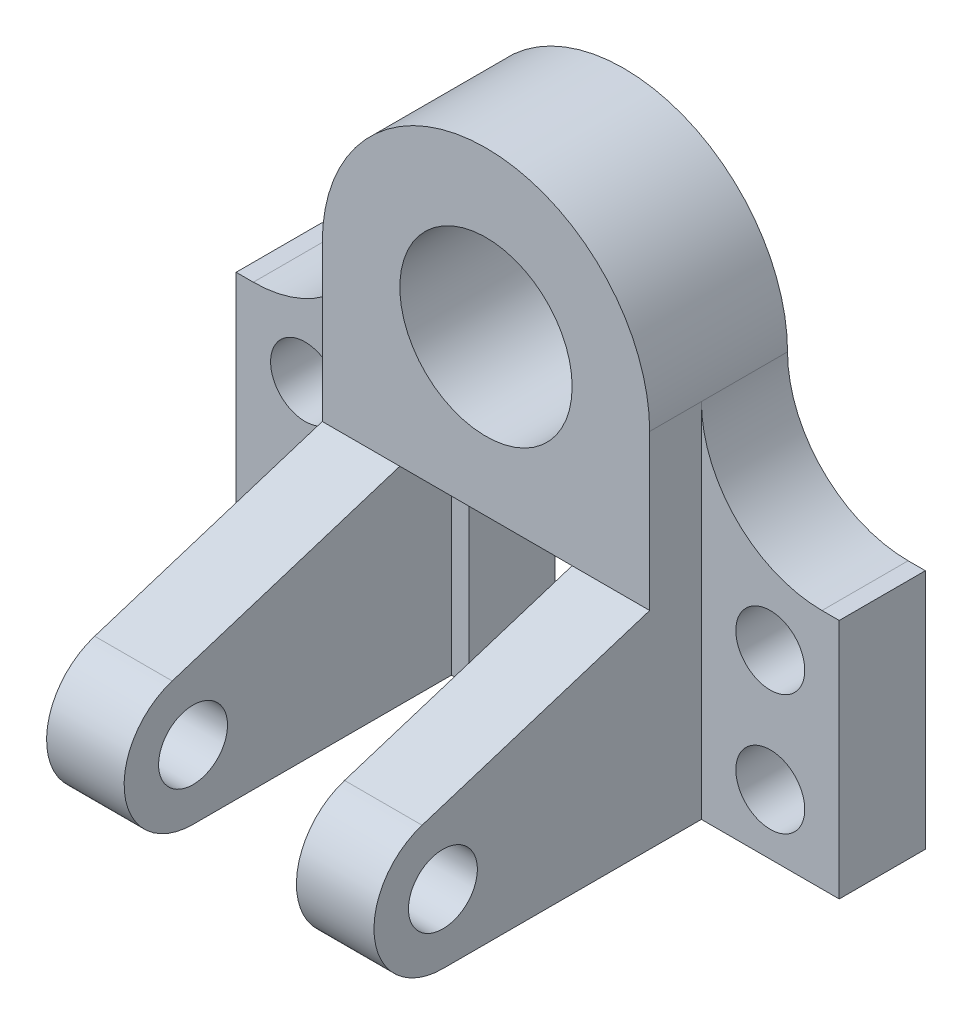
ISO-10303-21;
HEADER;
FILE_DESCRIPTION(('STEP AP214'),'2;1');
FILE_NAME('part.step','',(''),(''),'','','');
FILE_SCHEMA(('AUTOMOTIVE_DESIGN { 1 0 10303 214 1 1 1 1 }'));
ENDSEC;
DATA;
#1=APPLICATION_CONTEXT('core data for automotive mechanical design processes');
#2=APPLICATION_PROTOCOL_DEFINITION('international standard','automotive_design',2000,#1);
#3=PRODUCT_CONTEXT('',#1,'mechanical');
#4=PRODUCT('Part','Part','',(#3));
#5=PRODUCT_RELATED_PRODUCT_CATEGORY('part','',(#4));
#6=PRODUCT_DEFINITION_FORMATION('','',#4);
#7=PRODUCT_DEFINITION_CONTEXT('part definition',#1,'design');
#8=PRODUCT_DEFINITION('design','',#6,#7);
#9=PRODUCT_DEFINITION_SHAPE('','',#8);
#10=(LENGTH_UNIT() NAMED_UNIT(*) SI_UNIT(.MILLI.,.METRE.));
#11=(NAMED_UNIT(*) PLANE_ANGLE_UNIT() SI_UNIT($,.RADIAN.));
#12=(NAMED_UNIT(*) SI_UNIT($,.STERADIAN.) SOLID_ANGLE_UNIT());
#13=UNCERTAINTY_MEASURE_WITH_UNIT(LENGTH_MEASURE(1.E-05),#10,'distance_accuracy_value','');
#14=(GEOMETRIC_REPRESENTATION_CONTEXT(3) GLOBAL_UNCERTAINTY_ASSIGNED_CONTEXT((#13)) GLOBAL_UNIT_ASSIGNED_CONTEXT((#10,
#11,#12)) REPRESENTATION_CONTEXT('',''));
#15=CARTESIAN_POINT('',(0.,0.,0.));
#16=DIRECTION('',(0.,0.,1.));
#17=DIRECTION('',(1.,0.,0.));
#18=AXIS2_PLACEMENT_3D('',#15,#16,#17);
#19=CARTESIAN_POINT('',(-38.,-36.,32.));
#20=DIRECTION('',(0.,1.,0.));
#21=DIRECTION('',(0.,0.,1.));
#22=AXIS2_PLACEMENT_3D('',#19,#20,#21);
#23=PLANE('',#22);
#24=DIRECTION('',(0.,0.,-1.));
#25=VECTOR('',#24,1.);
#26=CARTESIAN_POINT('',(20.,-36.,32.));
#27=LINE('',#26,#25);
#28=CARTESIAN_POINT('',(20.,-36.,32.));
#29=VERTEX_POINT('',#28);
#30=CARTESIAN_POINT('',(20.,-36.,20.));
#31=VERTEX_POINT('',#30);
#32=EDGE_CURVE('E48',#29,#31,#27,.T.);
#33=ORIENTED_EDGE('',*,*,#32,.F.);
#34=DIRECTION('',(1.,0.,0.));
#35=VECTOR('',#34,1.);
#36=CARTESIAN_POINT('',(-38.,-36.,32.));
#37=LINE('',#36,#35);
#38=CARTESIAN_POINT('',(-20.,-36.,32.));
#39=VERTEX_POINT('',#38);
#40=EDGE_CURVE('E362',#39,#29,#37,.T.);
#41=ORIENTED_EDGE('',*,*,#40,.F.);
#42=DIRECTION('',(0.,0.,-1.));
#43=VECTOR('',#42,1.);
#44=CARTESIAN_POINT('',(-20.,-36.,32.));
#45=LINE('',#44,#43);
#46=CARTESIAN_POINT('',(-20.,-36.,20.));
#47=VERTEX_POINT('',#46);
#48=EDGE_CURVE('E236',#39,#47,#45,.T.);
#49=ORIENTED_EDGE('',*,*,#48,.T.);
#50=DIRECTION('',(-1.,0.,0.));
#51=VECTOR('',#50,1.);
#52=CARTESIAN_POINT('',(-38.,-36.,20.));
#53=LINE('',#52,#51);
#54=CARTESIAN_POINT('',(-16.,-36.,20.));
#55=VERTEX_POINT('',#54);
#56=EDGE_CURVE('E323',#55,#47,#53,.T.);
#57=ORIENTED_EDGE('',*,*,#56,.F.);
#58=DIRECTION('',(0.,0.,-1.));
#59=VECTOR('',#58,1.);
#60=CARTESIAN_POINT('',(-16.,-36.,20.));
#61=LINE('',#60,#59);
#62=CARTESIAN_POINT('',(-16.,-36.,0.));
#63=VERTEX_POINT('',#62);
#64=EDGE_CURVE('E341',#55,#63,#61,.T.);
#65=ORIENTED_EDGE('',*,*,#64,.T.);
#66=DIRECTION('',(1.,0.,0.));
#67=VECTOR('',#66,1.);
#68=CARTESIAN_POINT('',(-38.,-36.,0.));
#69=LINE('',#68,#67);
#70=CARTESIAN_POINT('',(16.,-36.,0.));
#71=VERTEX_POINT('',#70);
#72=EDGE_CURVE('E360',#63,#71,#69,.T.);
#73=ORIENTED_EDGE('',*,*,#72,.T.);
#74=DIRECTION('',(0.,0.,-1.));
#75=VECTOR('',#74,1.);
#76=CARTESIAN_POINT('',(16.,-36.,20.));
#77=LINE('',#76,#75);
#78=CARTESIAN_POINT('',(16.,-36.,20.));
#79=VERTEX_POINT('',#78);
#80=EDGE_CURVE('E296',#79,#71,#77,.T.);
#81=ORIENTED_EDGE('',*,*,#80,.F.);
#82=DIRECTION('',(-1.,0.,0.));
#83=VECTOR('',#82,1.);
#84=CARTESIAN_POINT('',(38.,-36.,20.));
#85=LINE('',#84,#83);
#86=EDGE_CURVE('E265',#31,#79,#85,.T.);
#87=ORIENTED_EDGE('',*,*,#86,.F.);
#88=EDGE_LOOP('',(#33,#41,#49,#57,#65,#73,#81,#87));
#89=FACE_BOUND('',#88,.T.);
#90=ADVANCED_FACE('F33',(#89),#23,.F.);
#91=CARTESIAN_POINT('',(0.,0.,20.));
#92=DIRECTION('',(0.,0.,-1.));
#93=DIRECTION('',(-1.,0.,0.));
#94=AXIS2_PLACEMENT_3D('',#91,#92,#93);
#95=PLANE('',#94);
#96=DIRECTION('',(0.,-1.,0.));
#97=VECTOR('',#96,1.);
#98=CARTESIAN_POINT('',(20.,-36.,20.));
#99=LINE('',#98,#97);
#100=CARTESIAN_POINT('',(20.,-84.,20.));
#101=VERTEX_POINT('',#100);
#102=EDGE_CURVE('E56',#31,#101,#99,.T.);
#103=ORIENTED_EDGE('',*,*,#102,.F.);
#104=ORIENTED_EDGE('',*,*,#86,.T.);
#105=DIRECTION('',(0.,-1.,0.));
#106=VECTOR('',#105,1.);
#107=CARTESIAN_POINT('',(16.,-84.,20.));
#108=LINE('',#107,#106);
#109=CARTESIAN_POINT('',(16.,-84.,20.));
#110=VERTEX_POINT('',#109);
#111=EDGE_CURVE('E267',#79,#110,#108,.T.);
#112=ORIENTED_EDGE('',*,*,#111,.T.);
#113=DIRECTION('',(1.,0.,0.));
#114=VECTOR('',#113,1.);
#115=CARTESIAN_POINT('',(70.,-84.,20.));
#116=LINE('',#115,#114);
#117=EDGE_CURVE('E271',#110,#101,#116,.T.);
#118=ORIENTED_EDGE('',*,*,#117,.T.);
#119=EDGE_LOOP('',(#103,#104,#112,#118));
#120=FACE_BOUND('',#119,.T.);
#121=ADVANCED_FACE('F487',(#120),#95,.F.);
#122=CARTESIAN_POINT('',(0.,0.,20.));
#123=DIRECTION('',(0.,0.,1.));
#124=DIRECTION('',(1.,0.,0.));
#125=AXIS2_PLACEMENT_3D('',#122,#123,#124);
#126=PLANE('',#125);
#127=ORIENTED_EDGE('',*,*,#56,.T.);
#128=DIRECTION('',(0.,-1.,0.));
#129=VECTOR('',#128,1.);
#130=CARTESIAN_POINT('',(-20.,-36.,20.));
#131=LINE('',#130,#129);
#132=CARTESIAN_POINT('',(-20.,-84.,20.));
#133=VERTEX_POINT('',#132);
#134=EDGE_CURVE('E238',#47,#133,#131,.T.);
#135=ORIENTED_EDGE('',*,*,#134,.T.);
#136=DIRECTION('',(1.,0.,0.));
#137=VECTOR('',#136,1.);
#138=CARTESIAN_POINT('',(-70.,-84.,20.));
#139=LINE('',#138,#137);
#140=CARTESIAN_POINT('',(-16.,-84.,20.));
#141=VERTEX_POINT('',#140);
#142=EDGE_CURVE('E315',#133,#141,#139,.T.);
#143=ORIENTED_EDGE('',*,*,#142,.T.);
#144=DIRECTION('',(0.,1.,0.));
#145=VECTOR('',#144,1.);
#146=CARTESIAN_POINT('',(-16.,-84.,20.));
#147=LINE('',#146,#145);
#148=EDGE_CURVE('E320',#141,#55,#147,.T.);
#149=ORIENTED_EDGE('',*,*,#148,.T.);
#150=EDGE_LOOP('',(#127,#135,#143,#149));
#151=FACE_BOUND('',#150,.T.);
#152=ADVANCED_FACE('F468',(#151),#126,.T.);
#153=CARTESIAN_POINT('',(38.,0.,32.));
#154=DIRECTION('',(-1.,0.,0.));
#155=DIRECTION('',(0.,-1.,0.));
#156=AXIS2_PLACEMENT_3D('',#153,#154,#155);
#157=PLANE('',#156);
#158=DIRECTION('',(0.,-1.,0.));
#159=VECTOR('',#158,1.);
#160=CARTESIAN_POINT('',(38.,-28.,20.));
#161=LINE('',#160,#159);
#162=CARTESIAN_POINT('',(38.,0.,20.));
#163=VERTEX_POINT('',#162);
#164=CARTESIAN_POINT('',(38.,-84.,20.));
#165=VERTEX_POINT('',#164);
#166=EDGE_CURVE('E278',#163,#165,#161,.T.);
#167=ORIENTED_EDGE('',*,*,#166,.F.);
#168=DIRECTION('',(0.,0.,-1.));
#169=VECTOR('',#168,1.);
#170=CARTESIAN_POINT('',(38.,0.,32.));
#171=LINE('',#170,#169);
#172=CARTESIAN_POINT('',(38.,0.,32.));
#173=VERTEX_POINT('',#172);
#174=EDGE_CURVE('E372',#173,#163,#171,.T.);
#175=ORIENTED_EDGE('',*,*,#174,.F.);
#176=DIRECTION('',(0.,1.,0.));
#177=VECTOR('',#176,1.);
#178=CARTESIAN_POINT('',(38.,0.,32.));
#179=LINE('',#178,#177);
#180=CARTESIAN_POINT('',(38.,-36.,32.));
#181=VERTEX_POINT('',#180);
#182=EDGE_CURVE('E366',#181,#173,#179,.T.);
#183=ORIENTED_EDGE('',*,*,#182,.F.);
#184=DIRECTION('',(0.,0.302169479251962,-0.953254218877943));
#185=VECTOR('',#184,1.);
#186=CARTESIAN_POINT('',(38.,-52.7479324979529,84.8347116680314));
#187=LINE('',#186,#185);
#188=CARTESIAN_POINT('',(38.,-52.7479324979529,84.8347116680314));
#189=VERTEX_POINT('',#188);
#190=EDGE_CURVE('E213',#189,#181,#187,.T.);
#191=ORIENTED_EDGE('',*,*,#190,.F.);
#192=CARTESIAN_POINT('',(38.,-68.,80.));
#193=DIRECTION('',(-1.,0.,0.));
#194=DIRECTION('',(0.,-1.,0.));
#195=AXIS2_PLACEMENT_3D('',#192,#193,#194);
#196=CIRCLE('',#195,16.);
#197=CARTESIAN_POINT('',(38.,-84.,80.));
#198=VERTEX_POINT('',#197);
#199=EDGE_CURVE('E199',#198,#189,#196,.T.);
#200=ORIENTED_EDGE('',*,*,#199,.F.);
#201=DIRECTION('',(0.,0.,1.));
#202=VECTOR('',#201,1.);
#203=CARTESIAN_POINT('',(38.,-84.,20.));
#204=LINE('',#203,#202);
#205=EDGE_CURVE('E210',#165,#198,#204,.T.);
#206=ORIENTED_EDGE('',*,*,#205,.F.);
#207=EDGE_LOOP('',(#167,#175,#183,#191,#200,#206));
#208=FACE_BOUND('',#207,.T.);
#209=CARTESIAN_POINT('',(38.,-68.,80.));
#210=DIRECTION('',(-1.,0.,0.));
#211=DIRECTION('',(0.,-1.,0.));
#212=AXIS2_PLACEMENT_3D('',#209,#210,#211);
#213=CIRCLE('',#212,7.99999999999999);
#214=CARTESIAN_POINT('',(38.,-76.,80.));
#215=VERTEX_POINT('',#214);
#216=EDGE_CURVE('E741',#215,#215,#213,.T.);
#217=ORIENTED_EDGE('',*,*,#216,.T.);
#218=EDGE_LOOP('',(#217));
#219=FACE_BOUND('',#218,.T.);
#220=ADVANCED_FACE('F414',(#208,#219),#157,.F.);
#221=CARTESIAN_POINT('',(0.,0.,32.));
#222=DIRECTION('',(0.,0.,1.));
#223=DIRECTION('',(1.,0.,0.));
#224=AXIS2_PLACEMENT_3D('',#221,#222,#223);
#225=PLANE('',#224);
#226=CARTESIAN_POINT('',(0.,0.,32.));
#227=DIRECTION('',(0.,0.,1.));
#228=DIRECTION('',(1.,0.,0.));
#229=AXIS2_PLACEMENT_3D('',#226,#227,#228);
#230=CIRCLE('',#229,38.);
#231=CARTESIAN_POINT('',(-38.,0.,32.));
#232=VERTEX_POINT('',#231);
#233=EDGE_CURVE('E356',#173,#232,#230,.T.);
#234=ORIENTED_EDGE('',*,*,#233,.T.);
#235=DIRECTION('',(0.,-1.,0.));
#236=VECTOR('',#235,1.);
#237=CARTESIAN_POINT('',(-38.,0.,32.));
#238=LINE('',#237,#236);
#239=CARTESIAN_POINT('',(-38.,-36.,32.));
#240=VERTEX_POINT('',#239);
#241=EDGE_CURVE('E359',#232,#240,#238,.T.);
#242=ORIENTED_EDGE('',*,*,#241,.T.);
#243=EDGE_CURVE('E363',#240,#39,#37,.T.);
#244=ORIENTED_EDGE('',*,*,#243,.T.);
#245=ORIENTED_EDGE('',*,*,#40,.T.);
#246=DIRECTION('',(1.,0.,0.));
#247=VECTOR('',#246,1.);
#248=CARTESIAN_POINT('',(20.,-36.,32.));
#249=LINE('',#248,#247);
#250=EDGE_CURVE('E194',#29,#181,#249,.T.);
#251=ORIENTED_EDGE('',*,*,#250,.T.);
#252=ORIENTED_EDGE('',*,*,#182,.T.);
#253=EDGE_LOOP('',(#234,#242,#244,#245,#251,#252));
#254=FACE_BOUND('',#253,.T.);
#255=CARTESIAN_POINT('',(0.,0.,32.));
#256=DIRECTION('',(0.,0.,1.));
#257=DIRECTION('',(1.,0.,0.));
#258=AXIS2_PLACEMENT_3D('',#255,#256,#257);
#259=CIRCLE('',#258,20.);
#260=CARTESIAN_POINT('',(20.,0.,32.));
#261=VERTEX_POINT('',#260);
#262=EDGE_CURVE('E350',#261,#261,#259,.T.);
#263=ORIENTED_EDGE('',*,*,#262,.F.);
#264=EDGE_LOOP('',(#263));
#265=FACE_BOUND('',#264,.T.);
#266=ADVANCED_FACE('F461',(#254,#265),#225,.T.);
#267=CARTESIAN_POINT('',(0.,0.,0.));
#268=DIRECTION('',(0.,0.,1.));
#269=DIRECTION('',(1.,0.,0.));
#270=AXIS2_PLACEMENT_3D('',#267,#268,#269);
#271=PLANE('',#270);
#272=DIRECTION('',(0.,-1.,0.));
#273=VECTOR('',#272,1.);
#274=CARTESIAN_POINT('',(16.,-84.,0.));
#275=LINE('',#274,#273);
#276=CARTESIAN_POINT('',(16.,-84.,0.));
#277=VERTEX_POINT('',#276);
#278=EDGE_CURVE('E262',#71,#277,#275,.T.);
#279=ORIENTED_EDGE('',*,*,#278,.F.);
#280=ORIENTED_EDGE('',*,*,#72,.F.);
#281=DIRECTION('',(0.,1.,0.));
#282=VECTOR('',#281,1.);
#283=CARTESIAN_POINT('',(-16.,-84.,0.));
#284=LINE('',#283,#282);
#285=CARTESIAN_POINT('',(-16.,-84.,0.));
#286=VERTEX_POINT('',#285);
#287=EDGE_CURVE('E335',#286,#63,#284,.T.);
#288=ORIENTED_EDGE('',*,*,#287,.F.);
#289=DIRECTION('',(1.,0.,0.));
#290=VECTOR('',#289,1.);
#291=CARTESIAN_POINT('',(-70.,-84.,0.));
#292=LINE('',#291,#290);
#293=CARTESIAN_POINT('',(-70.,-84.,0.));
#294=VERTEX_POINT('',#293);
#295=EDGE_CURVE('E333',#294,#286,#292,.T.);
#296=ORIENTED_EDGE('',*,*,#295,.F.);
#297=DIRECTION('',(0.,-1.,0.));
#298=VECTOR('',#297,1.);
#299=CARTESIAN_POINT('',(-70.,-28.,0.));
#300=LINE('',#299,#298);
#301=CARTESIAN_POINT('',(-70.,-28.,0.));
#302=VERTEX_POINT('',#301);
#303=EDGE_CURVE('E309',#302,#294,#300,.T.);
#304=ORIENTED_EDGE('',*,*,#303,.F.);
#305=DIRECTION('',(-1.,0.,0.));
#306=VECTOR('',#305,1.);
#307=CARTESIAN_POINT('',(-70.,-28.,0.));
#308=LINE('',#307,#306);
#309=CARTESIAN_POINT('',(-66.,-28.,0.));
#310=VERTEX_POINT('',#309);
#311=EDGE_CURVE('E316',#310,#302,#308,.T.);
#312=ORIENTED_EDGE('',*,*,#311,.F.);
#313=CARTESIAN_POINT('',(-66.,0.,0.));
#314=DIRECTION('',(0.,0.,1.));
#315=DIRECTION('',(1.,0.,0.));
#316=AXIS2_PLACEMENT_3D('',#313,#314,#315);
#317=CIRCLE('',#316,28.);
#318=CARTESIAN_POINT('',(-38.,0.,0.));
#319=VERTEX_POINT('',#318);
#320=EDGE_CURVE('E382',#310,#319,#317,.T.);
#321=ORIENTED_EDGE('',*,*,#320,.T.);
#322=CARTESIAN_POINT('',(0.,0.,0.));
#323=DIRECTION('',(0.,0.,1.));
#324=DIRECTION('',(1.,0.,0.));
#325=AXIS2_PLACEMENT_3D('',#322,#323,#324);
#326=CIRCLE('',#325,38.);
#327=CARTESIAN_POINT('',(38.,0.,0.));
#328=VERTEX_POINT('',#327);
#329=EDGE_CURVE('E353',#328,#319,#326,.T.);
#330=ORIENTED_EDGE('',*,*,#329,.F.);
#331=CARTESIAN_POINT('',(66.,0.,0.));
#332=DIRECTION('',(0.,0.,1.));
#333=DIRECTION('',(1.,0.,0.));
#334=AXIS2_PLACEMENT_3D('',#331,#332,#333);
#335=CIRCLE('',#334,28.);
#336=CARTESIAN_POINT('',(66.,-28.,0.));
#337=VERTEX_POINT('',#336);
#338=EDGE_CURVE('E41',#328,#337,#335,.T.);
#339=ORIENTED_EDGE('',*,*,#338,.T.);
#340=DIRECTION('',(-1.,0.,0.));
#341=VECTOR('',#340,1.);
#342=CARTESIAN_POINT('',(70.,-28.,0.));
#343=LINE('',#342,#341);
#344=CARTESIAN_POINT('',(70.,-28.,0.));
#345=VERTEX_POINT('',#344);
#346=EDGE_CURVE('E268',#345,#337,#343,.T.);
#347=ORIENTED_EDGE('',*,*,#346,.F.);
#348=DIRECTION('',(0.,1.,0.));
#349=VECTOR('',#348,1.);
#350=CARTESIAN_POINT('',(70.,-28.,0.));
#351=LINE('',#350,#349);
#352=CARTESIAN_POINT('',(70.,-84.,0.));
#353=VERTEX_POINT('',#352);
#354=EDGE_CURVE('E284',#353,#345,#351,.T.);
#355=ORIENTED_EDGE('',*,*,#354,.F.);
#356=DIRECTION('',(1.,0.,0.));
#357=VECTOR('',#356,1.);
#358=CARTESIAN_POINT('',(70.,-84.,0.));
#359=LINE('',#358,#357);
#360=EDGE_CURVE('E282',#277,#353,#359,.T.);
#361=ORIENTED_EDGE('',*,*,#360,.F.);
#362=EDGE_LOOP('',(#279,#280,#288,#296,#304,#312,#321,#330,#339,#347,#355,#361));
#363=FACE_BOUND('',#362,.T.);
#364=CARTESIAN_POINT('',(0.,0.,0.));
#365=DIRECTION('',(0.,0.,1.));
#366=DIRECTION('',(1.,0.,0.));
#367=AXIS2_PLACEMENT_3D('',#364,#365,#366);
#368=CIRCLE('',#367,20.);
#369=CARTESIAN_POINT('',(20.,0.,0.));
#370=VERTEX_POINT('',#369);
#371=EDGE_CURVE('E349',#370,#370,#368,.T.);
#372=ORIENTED_EDGE('',*,*,#371,.T.);
#373=EDGE_LOOP('',(#372));
#374=FACE_BOUND('',#373,.T.);
#375=CARTESIAN_POINT('',(-54.,-42.,0.));
#376=DIRECTION('',(0.,0.,1.));
#377=DIRECTION('',(1.,0.,0.));
#378=AXIS2_PLACEMENT_3D('',#375,#376,#377);
#379=CIRCLE('',#378,8.);
#380=CARTESIAN_POINT('',(-46.,-42.,0.));
#381=VERTEX_POINT('',#380);
#382=EDGE_CURVE('E303',#381,#381,#379,.T.);
#383=ORIENTED_EDGE('',*,*,#382,.T.);
#384=EDGE_LOOP('',(#383));
#385=FACE_BOUND('',#384,.T.);
#386=CARTESIAN_POINT('',(-54.,-70.,0.));
#387=DIRECTION('',(0.,0.,1.));
#388=DIRECTION('',(1.,0.,0.));
#389=AXIS2_PLACEMENT_3D('',#386,#387,#388);
#390=CIRCLE('',#389,8.);
#391=CARTESIAN_POINT('',(-46.,-70.,0.));
#392=VERTEX_POINT('',#391);
#393=EDGE_CURVE('E299',#392,#392,#390,.T.);
#394=ORIENTED_EDGE('',*,*,#393,.T.);
#395=EDGE_LOOP('',(#394));
#396=FACE_BOUND('',#395,.T.);
#397=CARTESIAN_POINT('',(54.,-70.,0.));
#398=DIRECTION('',(0.,0.,1.));
#399=DIRECTION('',(-1.,0.,0.));
#400=AXIS2_PLACEMENT_3D('',#397,#398,#399);
#401=CIRCLE('',#400,8.);
#402=CARTESIAN_POINT('',(46.,-70.,0.));
#403=VERTEX_POINT('',#402);
#404=EDGE_CURVE('E256',#403,#403,#401,.T.);
#405=ORIENTED_EDGE('',*,*,#404,.T.);
#406=EDGE_LOOP('',(#405));
#407=FACE_BOUND('',#406,.T.);
#408=CARTESIAN_POINT('',(54.,-42.,0.));
#409=DIRECTION('',(0.,0.,1.));
#410=DIRECTION('',(-1.,0.,0.));
#411=AXIS2_PLACEMENT_3D('',#408,#409,#410);
#412=CIRCLE('',#411,8.);
#413=CARTESIAN_POINT('',(46.,-42.,0.));
#414=VERTEX_POINT('',#413);
#415=EDGE_CURVE('E251',#414,#414,#412,.T.);
#416=ORIENTED_EDGE('',*,*,#415,.T.);
#417=EDGE_LOOP('',(#416));
#418=FACE_BOUND('',#417,.T.);
#419=ADVANCED_FACE('F391',(#363,#374,#385,#396,#407,#418),#271,.F.);
#420=CARTESIAN_POINT('',(0.,0.,32.));
#421=DIRECTION('',(0.,0.,-1.));
#422=DIRECTION('',(-1.,0.,0.));
#423=AXIS2_PLACEMENT_3D('',#420,#421,#422);
#424=CYLINDRICAL_SURFACE('',#423,38.);
#425=ORIENTED_EDGE('',*,*,#329,.T.);
#426=DIRECTION('',(0.,0.,-1.));
#427=VECTOR('',#426,1.);
#428=CARTESIAN_POINT('',(-38.,0.,32.));
#429=LINE('',#428,#427);
#430=CARTESIAN_POINT('',(-38.,0.,20.));
#431=VERTEX_POINT('',#430);
#432=EDGE_CURVE('E375',#431,#319,#429,.T.);
#433=ORIENTED_EDGE('',*,*,#432,.F.);
#434=EDGE_CURVE('E376',#232,#431,#429,.T.);
#435=ORIENTED_EDGE('',*,*,#434,.F.);
#436=ORIENTED_EDGE('',*,*,#233,.F.);
#437=ORIENTED_EDGE('',*,*,#174,.T.);
#438=EDGE_CURVE('E368',#163,#328,#171,.T.);
#439=ORIENTED_EDGE('',*,*,#438,.T.);
#440=EDGE_LOOP('',(#425,#433,#435,#436,#437,#439));
#441=FACE_BOUND('',#440,.T.);
#442=ADVANCED_FACE('F410',(#441),#424,.T.);
#443=CARTESIAN_POINT('',(-38.,0.,32.));
#444=DIRECTION('',(1.,0.,0.));
#445=DIRECTION('',(0.,1.,0.));
#446=AXIS2_PLACEMENT_3D('',#443,#444,#445);
#447=PLANE('',#446);
#448=ORIENTED_EDGE('',*,*,#434,.T.);
#449=DIRECTION('',(0.,1.,0.));
#450=VECTOR('',#449,1.);
#451=CARTESIAN_POINT('',(-38.,-28.,20.));
#452=LINE('',#451,#450);
#453=CARTESIAN_POINT('',(-38.,-84.,20.));
#454=VERTEX_POINT('',#453);
#455=EDGE_CURVE('E326',#454,#431,#452,.T.);
#456=ORIENTED_EDGE('',*,*,#455,.F.);
#457=DIRECTION('',(0.,0.,1.));
#458=VECTOR('',#457,1.);
#459=CARTESIAN_POINT('',(-38.,-84.,20.));
#460=LINE('',#459,#458);
#461=CARTESIAN_POINT('',(-38.,-84.,80.));
#462=VERTEX_POINT('',#461);
#463=EDGE_CURVE('E223',#454,#462,#460,.T.);
#464=ORIENTED_EDGE('',*,*,#463,.T.);
#465=CARTESIAN_POINT('',(-38.,-68.,80.));
#466=DIRECTION('',(-1.,0.,0.));
#467=DIRECTION('',(0.,-1.,0.));
#468=AXIS2_PLACEMENT_3D('',#465,#466,#467);
#469=CIRCLE('',#468,16.);
#470=CARTESIAN_POINT('',(-38.,-52.7479324979529,84.8347116680314));
#471=VERTEX_POINT('',#470);
#472=EDGE_CURVE('E244',#462,#471,#469,.T.);
#473=ORIENTED_EDGE('',*,*,#472,.T.);
#474=DIRECTION('',(0.,0.302169479251962,-0.953254218877943));
#475=VECTOR('',#474,1.);
#476=CARTESIAN_POINT('',(-38.,-52.7479324979529,84.8347116680314));
#477=LINE('',#476,#475);
#478=EDGE_CURVE('E230',#471,#240,#477,.T.);
#479=ORIENTED_EDGE('',*,*,#478,.T.);
#480=ORIENTED_EDGE('',*,*,#241,.F.);
#481=EDGE_LOOP('',(#448,#456,#464,#473,#479,#480));
#482=FACE_BOUND('',#481,.T.);
#483=CARTESIAN_POINT('',(-38.,-68.,80.));
#484=DIRECTION('',(-1.,0.,0.));
#485=DIRECTION('',(0.,-1.,0.));
#486=AXIS2_PLACEMENT_3D('',#483,#484,#485);
#487=CIRCLE('',#486,7.99999999999999);
#488=CARTESIAN_POINT('',(-38.,-76.,80.));
#489=VERTEX_POINT('',#488);
#490=EDGE_CURVE('E217',#489,#489,#487,.T.);
#491=ORIENTED_EDGE('',*,*,#490,.F.);
#492=EDGE_LOOP('',(#491));
#493=FACE_BOUND('',#492,.T.);
#494=ADVANCED_FACE('F456',(#482,#493),#447,.F.);
#495=CARTESIAN_POINT('',(0.,0.,32.));
#496=DIRECTION('',(0.,0.,-1.));
#497=DIRECTION('',(-1.,0.,0.));
#498=AXIS2_PLACEMENT_3D('',#495,#496,#497);
#499=CYLINDRICAL_SURFACE('',#498,20.);
#500=ORIENTED_EDGE('',*,*,#262,.T.);
#501=EDGE_LOOP('',(#500));
#502=FACE_BOUND('',#501,.T.);
#503=ORIENTED_EDGE('',*,*,#371,.F.);
#504=EDGE_LOOP('',(#503));
#505=FACE_BOUND('',#504,.T.);
#506=ADVANCED_FACE('F498',(#502,#505),#499,.F.);
#507=CARTESIAN_POINT('',(-70.,-84.,20.));
#508=VERTEX_POINT('',#507);
#509=EDGE_CURVE('E317',#508,#454,#139,.T.);
#510=ORIENTED_EDGE('',*,*,#509,.T.);
#511=ORIENTED_EDGE('',*,*,#455,.T.);
#512=CARTESIAN_POINT('',(-66.,0.,20.));
#513=DIRECTION('',(0.,0.,1.));
#514=DIRECTION('',(1.,0.,0.));
#515=AXIS2_PLACEMENT_3D('',#512,#513,#514);
#516=CIRCLE('',#515,28.);
#517=CARTESIAN_POINT('',(-66.,-28.,20.));
#518=VERTEX_POINT('',#517);
#519=EDGE_CURVE('E384',#431,#518,#516,.F.);
#520=ORIENTED_EDGE('',*,*,#519,.T.);
#521=DIRECTION('',(-1.,0.,0.));
#522=VECTOR('',#521,1.);
#523=CARTESIAN_POINT('',(-70.,-28.,20.));
#524=LINE('',#523,#522);
#525=CARTESIAN_POINT('',(-70.,-28.,20.));
#526=VERTEX_POINT('',#525);
#527=EDGE_CURVE('E328',#518,#526,#524,.T.);
#528=ORIENTED_EDGE('',*,*,#527,.T.);
#529=DIRECTION('',(0.,-1.,0.));
#530=VECTOR('',#529,1.);
#531=CARTESIAN_POINT('',(-70.,-28.,20.));
#532=LINE('',#531,#530);
#533=EDGE_CURVE('E312',#526,#508,#532,.T.);
#534=ORIENTED_EDGE('',*,*,#533,.T.);
#535=EDGE_LOOP('',(#510,#511,#520,#528,#534));
#536=FACE_BOUND('',#535,.T.);
#537=CARTESIAN_POINT('',(-54.,-42.,20.));
#538=DIRECTION('',(0.,0.,1.));
#539=DIRECTION('',(1.,0.,0.));
#540=AXIS2_PLACEMENT_3D('',#537,#538,#539);
#541=CIRCLE('',#540,8.);
#542=CARTESIAN_POINT('',(-46.,-42.,20.));
#543=VERTEX_POINT('',#542);
#544=EDGE_CURVE('E306',#543,#543,#541,.T.);
#545=ORIENTED_EDGE('',*,*,#544,.F.);
#546=EDGE_LOOP('',(#545));
#547=FACE_BOUND('',#546,.T.);
#548=CARTESIAN_POINT('',(-54.,-70.,20.));
#549=DIRECTION('',(0.,0.,1.));
#550=DIRECTION('',(1.,0.,0.));
#551=AXIS2_PLACEMENT_3D('',#548,#549,#550);
#552=CIRCLE('',#551,8.);
#553=CARTESIAN_POINT('',(-46.,-70.,20.));
#554=VERTEX_POINT('',#553);
#555=EDGE_CURVE('E300',#554,#554,#552,.T.);
#556=ORIENTED_EDGE('',*,*,#555,.F.);
#557=EDGE_LOOP('',(#556));
#558=FACE_BOUND('',#557,.T.);
#559=ADVANCED_FACE('F532',(#536,#547,#558),#126,.T.);
#560=CARTESIAN_POINT('',(-70.,-28.,20.));
#561=DIRECTION('',(1.,0.,0.));
#562=DIRECTION('',(0.,0.,-1.));
#563=AXIS2_PLACEMENT_3D('',#560,#561,#562);
#564=PLANE('',#563);
#565=ORIENTED_EDGE('',*,*,#303,.T.);
#566=DIRECTION('',(0.,0.,-1.));
#567=VECTOR('',#566,1.);
#568=CARTESIAN_POINT('',(-70.,-84.,20.));
#569=LINE('',#568,#567);
#570=EDGE_CURVE('E346',#508,#294,#569,.T.);
#571=ORIENTED_EDGE('',*,*,#570,.F.);
#572=ORIENTED_EDGE('',*,*,#533,.F.);
#573=DIRECTION('',(0.,0.,-1.));
#574=VECTOR('',#573,1.);
#575=CARTESIAN_POINT('',(-70.,-28.,20.));
#576=LINE('',#575,#574);
#577=EDGE_CURVE('E330',#526,#302,#576,.T.);
#578=ORIENTED_EDGE('',*,*,#577,.T.);
#579=EDGE_LOOP('',(#565,#571,#572,#578));
#580=FACE_BOUND('',#579,.T.);
#581=ADVANCED_FACE('F443',(#580),#564,.F.);
#582=CARTESIAN_POINT('',(-70.,-84.,20.));
#583=DIRECTION('',(0.,1.,0.));
#584=DIRECTION('',(-1.,0.,0.));
#585=AXIS2_PLACEMENT_3D('',#582,#583,#584);
#586=PLANE('',#585);
#587=ORIENTED_EDGE('',*,*,#295,.T.);
#588=DIRECTION('',(0.,0.,-1.));
#589=VECTOR('',#588,1.);
#590=CARTESIAN_POINT('',(-16.,-84.,20.));
#591=LINE('',#590,#589);
#592=EDGE_CURVE('E343',#141,#286,#591,.T.);
#593=ORIENTED_EDGE('',*,*,#592,.F.);
#594=ORIENTED_EDGE('',*,*,#142,.F.);
#595=DIRECTION('',(0.,0.,1.));
#596=VECTOR('',#595,1.);
#597=CARTESIAN_POINT('',(-20.,-84.,20.));
#598=LINE('',#597,#596);
#599=CARTESIAN_POINT('',(-20.,-84.,80.));
#600=VERTEX_POINT('',#599);
#601=EDGE_CURVE('E226',#133,#600,#598,.T.);
#602=ORIENTED_EDGE('',*,*,#601,.T.);
#603=DIRECTION('',(-1.,0.,0.));
#604=VECTOR('',#603,1.);
#605=CARTESIAN_POINT('',(-20.,-84.,80.));
#606=LINE('',#605,#604);
#607=EDGE_CURVE('E241',#600,#462,#606,.T.);
#608=ORIENTED_EDGE('',*,*,#607,.T.);
#609=ORIENTED_EDGE('',*,*,#463,.F.);
#610=ORIENTED_EDGE('',*,*,#509,.F.);
#611=ORIENTED_EDGE('',*,*,#570,.T.);
#612=EDGE_LOOP('',(#587,#593,#594,#602,#608,#609,#610,#611));
#613=FACE_BOUND('',#612,.T.);
#614=ADVANCED_FACE('F438',(#613),#586,.F.);
#615=CARTESIAN_POINT('',(-16.,-84.,20.));
#616=DIRECTION('',(-1.,0.,0.));
#617=DIRECTION('',(0.,0.,1.));
#618=AXIS2_PLACEMENT_3D('',#615,#616,#617);
#619=PLANE('',#618);
#620=ORIENTED_EDGE('',*,*,#287,.T.);
#621=ORIENTED_EDGE('',*,*,#64,.F.);
#622=ORIENTED_EDGE('',*,*,#148,.F.);
#623=ORIENTED_EDGE('',*,*,#592,.T.);
#624=EDGE_LOOP('',(#620,#621,#622,#623));
#625=FACE_BOUND('',#624,.T.);
#626=ADVANCED_FACE('F434',(#625),#619,.F.);
#627=CARTESIAN_POINT('',(-70.,-28.,20.));
#628=DIRECTION('',(0.,-1.,0.));
#629=DIRECTION('',(0.,0.,-1.));
#630=AXIS2_PLACEMENT_3D('',#627,#628,#629);
#631=PLANE('',#630);
#632=ORIENTED_EDGE('',*,*,#527,.F.);
#633=DIRECTION('',(0.,0.,-1.));
#634=VECTOR('',#633,1.);
#635=CARTESIAN_POINT('',(-66.,-28.,0.));
#636=LINE('',#635,#634);
#637=EDGE_CURVE('E379',#518,#310,#636,.T.);
#638=ORIENTED_EDGE('',*,*,#637,.T.);
#639=ORIENTED_EDGE('',*,*,#311,.T.);
#640=ORIENTED_EDGE('',*,*,#577,.F.);
#641=EDGE_LOOP('',(#632,#638,#639,#640));
#642=FACE_BOUND('',#641,.T.);
#643=ADVANCED_FACE('F448',(#642),#631,.F.);
#644=CARTESIAN_POINT('',(-54.,-42.,20.));
#645=DIRECTION('',(0.,0.,-1.));
#646=DIRECTION('',(-1.,0.,0.));
#647=AXIS2_PLACEMENT_3D('',#644,#645,#646);
#648=CYLINDRICAL_SURFACE('',#647,8.);
#649=ORIENTED_EDGE('',*,*,#544,.T.);
#650=EDGE_LOOP('',(#649));
#651=FACE_BOUND('',#650,.T.);
#652=ORIENTED_EDGE('',*,*,#382,.F.);
#653=EDGE_LOOP('',(#652));
#654=FACE_BOUND('',#653,.T.);
#655=ADVANCED_FACE('F527',(#651,#654),#648,.F.);
#656=CARTESIAN_POINT('',(-54.,-70.,20.));
#657=DIRECTION('',(0.,0.,-1.));
#658=DIRECTION('',(-1.,0.,0.));
#659=AXIS2_PLACEMENT_3D('',#656,#657,#658);
#660=CYLINDRICAL_SURFACE('',#659,8.);
#661=ORIENTED_EDGE('',*,*,#555,.T.);
#662=EDGE_LOOP('',(#661));
#663=FACE_BOUND('',#662,.T.);
#664=ORIENTED_EDGE('',*,*,#393,.F.);
#665=EDGE_LOOP('',(#664));
#666=FACE_BOUND('',#665,.T.);
#667=ADVANCED_FACE('F516',(#663,#666),#660,.F.);
#668=ORIENTED_EDGE('',*,*,#166,.T.);
#669=CARTESIAN_POINT('',(70.,-84.,20.));
#670=VERTEX_POINT('',#669);
#671=EDGE_CURVE('E270',#165,#670,#116,.T.);
#672=ORIENTED_EDGE('',*,*,#671,.T.);
#673=DIRECTION('',(0.,1.,0.));
#674=VECTOR('',#673,1.);
#675=CARTESIAN_POINT('',(70.,-28.,20.));
#676=LINE('',#675,#674);
#677=CARTESIAN_POINT('',(70.,-28.,20.));
#678=VERTEX_POINT('',#677);
#679=EDGE_CURVE('E273',#670,#678,#676,.T.);
#680=ORIENTED_EDGE('',*,*,#679,.T.);
#681=DIRECTION('',(-1.,0.,0.));
#682=VECTOR('',#681,1.);
#683=CARTESIAN_POINT('',(70.,-28.,20.));
#684=LINE('',#683,#682);
#685=CARTESIAN_POINT('',(66.,-28.,20.));
#686=VERTEX_POINT('',#685);
#687=EDGE_CURVE('E275',#678,#686,#684,.T.);
#688=ORIENTED_EDGE('',*,*,#687,.T.);
#689=CARTESIAN_POINT('',(66.,0.,20.));
#690=DIRECTION('',(0.,0.,-1.));
#691=DIRECTION('',(-1.,0.,0.));
#692=AXIS2_PLACEMENT_3D('',#689,#690,#691);
#693=CIRCLE('',#692,28.);
#694=EDGE_CURVE('E11',#686,#163,#693,.T.);
#695=ORIENTED_EDGE('',*,*,#694,.T.);
#696=EDGE_LOOP('',(#668,#672,#680,#688,#695));
#697=FACE_BOUND('',#696,.T.);
#698=CARTESIAN_POINT('',(54.,-70.,20.));
#699=DIRECTION('',(0.,0.,1.));
#700=DIRECTION('',(-1.,0.,0.));
#701=AXIS2_PLACEMENT_3D('',#698,#699,#700);
#702=CIRCLE('',#701,8.);
#703=CARTESIAN_POINT('',(46.,-70.,20.));
#704=VERTEX_POINT('',#703);
#705=EDGE_CURVE('E259',#704,#704,#702,.T.);
#706=ORIENTED_EDGE('',*,*,#705,.F.);
#707=EDGE_LOOP('',(#706));
#708=FACE_BOUND('',#707,.T.);
#709=CARTESIAN_POINT('',(54.,-42.,20.));
#710=DIRECTION('',(0.,0.,1.));
#711=DIRECTION('',(-1.,0.,0.));
#712=AXIS2_PLACEMENT_3D('',#709,#710,#711);
#713=CIRCLE('',#712,8.);
#714=CARTESIAN_POINT('',(46.,-42.,20.));
#715=VERTEX_POINT('',#714);
#716=EDGE_CURVE('E253',#715,#715,#713,.T.);
#717=ORIENTED_EDGE('',*,*,#716,.F.);
#718=EDGE_LOOP('',(#717));
#719=FACE_BOUND('',#718,.T.);
#720=ADVANCED_FACE('F404',(#697,#708,#719),#95,.F.);
#721=CARTESIAN_POINT('',(16.,-84.,20.));
#722=DIRECTION('',(1.,0.,0.));
#723=DIRECTION('',(0.,1.,0.));
#724=AXIS2_PLACEMENT_3D('',#721,#722,#723);
#725=PLANE('',#724);
#726=ORIENTED_EDGE('',*,*,#278,.T.);
#727=DIRECTION('',(0.,0.,-1.));
#728=VECTOR('',#727,1.);
#729=CARTESIAN_POINT('',(16.,-84.,20.));
#730=LINE('',#729,#728);
#731=EDGE_CURVE('E293',#110,#277,#730,.T.);
#732=ORIENTED_EDGE('',*,*,#731,.F.);
#733=ORIENTED_EDGE('',*,*,#111,.F.);
#734=ORIENTED_EDGE('',*,*,#80,.T.);
#735=EDGE_LOOP('',(#726,#732,#733,#734));
#736=FACE_BOUND('',#735,.T.);
#737=ADVANCED_FACE('F429',(#736),#725,.F.);
#738=CARTESIAN_POINT('',(70.,-84.,20.));
#739=DIRECTION('',(0.,1.,0.));
#740=DIRECTION('',(-1.,0.,0.));
#741=AXIS2_PLACEMENT_3D('',#738,#739,#740);
#742=PLANE('',#741);
#743=ORIENTED_EDGE('',*,*,#360,.T.);
#744=DIRECTION('',(0.,0.,-1.));
#745=VECTOR('',#744,1.);
#746=CARTESIAN_POINT('',(70.,-84.,20.));
#747=LINE('',#746,#745);
#748=EDGE_CURVE('E290',#670,#353,#747,.T.);
#749=ORIENTED_EDGE('',*,*,#748,.F.);
#750=ORIENTED_EDGE('',*,*,#671,.F.);
#751=ORIENTED_EDGE('',*,*,#205,.T.);
#752=DIRECTION('',(1.,0.,0.));
#753=VECTOR('',#752,1.);
#754=CARTESIAN_POINT('',(20.,-84.,80.));
#755=LINE('',#754,#753);
#756=CARTESIAN_POINT('',(20.,-84.,80.));
#757=VERTEX_POINT('',#756);
#758=EDGE_CURVE('E203',#757,#198,#755,.T.);
#759=ORIENTED_EDGE('',*,*,#758,.F.);
#760=DIRECTION('',(0.,0.,1.));
#761=VECTOR('',#760,1.);
#762=CARTESIAN_POINT('',(20.,-84.,20.));
#763=LINE('',#762,#761);
#764=EDGE_CURVE('E190',#101,#757,#763,.T.);
#765=ORIENTED_EDGE('',*,*,#764,.F.);
#766=ORIENTED_EDGE('',*,*,#117,.F.);
#767=ORIENTED_EDGE('',*,*,#731,.T.);
#768=EDGE_LOOP('',(#743,#749,#750,#751,#759,#765,#766,#767));
#769=FACE_BOUND('',#768,.T.);
#770=ADVANCED_FACE('F418',(#769),#742,.F.);
#771=CARTESIAN_POINT('',(70.,-28.,20.));
#772=DIRECTION('',(-1.,0.,0.));
#773=DIRECTION('',(0.,-1.,0.));
#774=AXIS2_PLACEMENT_3D('',#771,#772,#773);
#775=PLANE('',#774);
#776=ORIENTED_EDGE('',*,*,#354,.T.);
#777=DIRECTION('',(0.,0.,-1.));
#778=VECTOR('',#777,1.);
#779=CARTESIAN_POINT('',(70.,-28.,20.));
#780=LINE('',#779,#778);
#781=EDGE_CURVE('E280',#678,#345,#780,.T.);
#782=ORIENTED_EDGE('',*,*,#781,.F.);
#783=ORIENTED_EDGE('',*,*,#679,.F.);
#784=ORIENTED_EDGE('',*,*,#748,.T.);
#785=EDGE_LOOP('',(#776,#782,#783,#784));
#786=FACE_BOUND('',#785,.T.);
#787=ADVANCED_FACE('F422',(#786),#775,.F.);
#788=CARTESIAN_POINT('',(70.,-28.,20.));
#789=DIRECTION('',(0.,-1.,0.));
#790=DIRECTION('',(1.,0.,0.));
#791=AXIS2_PLACEMENT_3D('',#788,#789,#790);
#792=PLANE('',#791);
#793=ORIENTED_EDGE('',*,*,#346,.T.);
#794=DIRECTION('',(0.,0.,-1.));
#795=VECTOR('',#794,1.);
#796=CARTESIAN_POINT('',(66.,-28.,20.));
#797=LINE('',#796,#795);
#798=EDGE_CURVE('E386',#337,#686,#797,.F.);
#799=ORIENTED_EDGE('',*,*,#798,.T.);
#800=ORIENTED_EDGE('',*,*,#687,.F.);
#801=ORIENTED_EDGE('',*,*,#781,.T.);
#802=EDGE_LOOP('',(#793,#799,#800,#801));
#803=FACE_BOUND('',#802,.T.);
#804=ADVANCED_FACE('F399',(#803),#792,.F.);
#805=CARTESIAN_POINT('',(54.,-70.,20.));
#806=DIRECTION('',(0.,0.,-1.));
#807=DIRECTION('',(-1.,0.,0.));
#808=AXIS2_PLACEMENT_3D('',#805,#806,#807);
#809=CYLINDRICAL_SURFACE('',#808,8.);
#810=ORIENTED_EDGE('',*,*,#705,.T.);
#811=EDGE_LOOP('',(#810));
#812=FACE_BOUND('',#811,.T.);
#813=ORIENTED_EDGE('',*,*,#404,.F.);
#814=EDGE_LOOP('',(#813));
#815=FACE_BOUND('',#814,.T.);
#816=ADVANCED_FACE('F505',(#812,#815),#809,.F.);
#817=CARTESIAN_POINT('',(54.,-42.,20.));
#818=DIRECTION('',(0.,0.,-1.));
#819=DIRECTION('',(-1.,0.,0.));
#820=AXIS2_PLACEMENT_3D('',#817,#818,#819);
#821=CYLINDRICAL_SURFACE('',#820,8.);
#822=ORIENTED_EDGE('',*,*,#716,.T.);
#823=EDGE_LOOP('',(#822));
#824=FACE_BOUND('',#823,.T.);
#825=ORIENTED_EDGE('',*,*,#415,.F.);
#826=EDGE_LOOP('',(#825));
#827=FACE_BOUND('',#826,.T.);
#828=ADVANCED_FACE('F501',(#824,#827),#821,.F.);
#829=CARTESIAN_POINT('',(-66.,0.,20.));
#830=DIRECTION('',(0.,0.,1.));
#831=DIRECTION('',(1.,0.,0.));
#832=AXIS2_PLACEMENT_3D('',#829,#830,#831);
#833=CYLINDRICAL_SURFACE('',#832,28.);
#834=ORIENTED_EDGE('',*,*,#519,.F.);
#835=ORIENTED_EDGE('',*,*,#432,.T.);
#836=ORIENTED_EDGE('',*,*,#320,.F.);
#837=ORIENTED_EDGE('',*,*,#637,.F.);
#838=EDGE_LOOP('',(#834,#835,#836,#837));
#839=FACE_BOUND('',#838,.T.);
#840=ADVANCED_FACE('F452',(#839),#833,.F.);
#841=CARTESIAN_POINT('',(66.,0.,32.));
#842=DIRECTION('',(0.,0.,1.));
#843=DIRECTION('',(1.,0.,0.));
#844=AXIS2_PLACEMENT_3D('',#841,#842,#843);
#845=CYLINDRICAL_SURFACE('',#844,28.);
#846=ORIENTED_EDGE('',*,*,#694,.F.);
#847=ORIENTED_EDGE('',*,*,#798,.F.);
#848=ORIENTED_EDGE('',*,*,#338,.F.);
#849=ORIENTED_EDGE('',*,*,#438,.F.);
#850=EDGE_LOOP('',(#846,#847,#848,#849));
#851=FACE_BOUND('',#850,.T.);
#852=ADVANCED_FACE('F35',(#851),#845,.F.);
#853=CARTESIAN_POINT('',(-20.,-52.7479324979529,84.8347116680314));
#854=DIRECTION('',(0.,0.953254218877943,0.302169479251962));
#855=DIRECTION('',(0.,-0.302169479251962,0.953254218877943));
#856=AXIS2_PLACEMENT_3D('',#853,#854,#855);
#857=PLANE('',#856);
#858=ORIENTED_EDGE('',*,*,#478,.F.);
#859=DIRECTION('',(-1.,0.,0.));
#860=VECTOR('',#859,1.);
#861=CARTESIAN_POINT('',(-20.,-52.7479324979529,84.8347116680314));
#862=LINE('',#861,#860);
#863=CARTESIAN_POINT('',(-20.,-52.7479324979529,84.8347116680314));
#864=VERTEX_POINT('',#863);
#865=EDGE_CURVE('E249',#864,#471,#862,.T.);
#866=ORIENTED_EDGE('',*,*,#865,.F.);
#867=DIRECTION('',(0.,0.302169479251962,-0.953254218877943));
#868=VECTOR('',#867,1.);
#869=CARTESIAN_POINT('',(-20.,-52.7479324979529,84.8347116680314));
#870=LINE('',#869,#868);
#871=EDGE_CURVE('E233',#864,#39,#870,.T.);
#872=ORIENTED_EDGE('',*,*,#871,.T.);
#873=ORIENTED_EDGE('',*,*,#243,.F.);
#874=EDGE_LOOP('',(#858,#866,#872,#873));
#875=FACE_BOUND('',#874,.T.);
#876=ADVANCED_FACE('F477',(#875),#857,.T.);
#877=CARTESIAN_POINT('',(-20.,-68.,80.));
#878=DIRECTION('',(-1.,0.,0.));
#879=DIRECTION('',(0.,-1.,0.));
#880=AXIS2_PLACEMENT_3D('',#877,#878,#879);
#881=CYLINDRICAL_SURFACE('',#880,16.);
#882=ORIENTED_EDGE('',*,*,#472,.F.);
#883=ORIENTED_EDGE('',*,*,#607,.F.);
#884=CARTESIAN_POINT('',(-20.,-68.,80.));
#885=DIRECTION('',(-1.,0.,0.));
#886=DIRECTION('',(0.,-1.,0.));
#887=AXIS2_PLACEMENT_3D('',#884,#885,#886);
#888=CIRCLE('',#887,16.);
#889=EDGE_CURVE('E229',#600,#864,#888,.T.);
#890=ORIENTED_EDGE('',*,*,#889,.T.);
#891=ORIENTED_EDGE('',*,*,#865,.T.);
#892=EDGE_LOOP('',(#882,#883,#890,#891));
#893=FACE_BOUND('',#892,.T.);
#894=ADVANCED_FACE('F475',(#893),#881,.T.);
#895=CARTESIAN_POINT('',(-20.,-68.,80.));
#896=DIRECTION('',(-1.,0.,0.));
#897=DIRECTION('',(0.,-1.,0.));
#898=AXIS2_PLACEMENT_3D('',#895,#896,#897);
#899=PLANE('',#898);
#900=CARTESIAN_POINT('',(-20.,-68.,80.));
#901=DIRECTION('',(-1.,0.,0.));
#902=DIRECTION('',(0.,-1.,0.));
#903=AXIS2_PLACEMENT_3D('',#900,#901,#902);
#904=CIRCLE('',#903,7.99999999999999);
#905=CARTESIAN_POINT('',(-20.,-76.,80.));
#906=VERTEX_POINT('',#905);
#907=EDGE_CURVE('E220',#906,#906,#904,.T.);
#908=ORIENTED_EDGE('',*,*,#907,.T.);
#909=EDGE_LOOP('',(#908));
#910=FACE_BOUND('',#909,.T.);
#911=ORIENTED_EDGE('',*,*,#601,.F.);
#912=ORIENTED_EDGE('',*,*,#134,.F.);
#913=ORIENTED_EDGE('',*,*,#48,.F.);
#914=ORIENTED_EDGE('',*,*,#871,.F.);
#915=ORIENTED_EDGE('',*,*,#889,.F.);
#916=EDGE_LOOP('',(#911,#912,#913,#914,#915));
#917=FACE_BOUND('',#916,.T.);
#918=ADVANCED_FACE('F470',(#910,#917),#899,.F.);
#919=CARTESIAN_POINT('',(-20.,-68.,80.));
#920=DIRECTION('',(-1.,0.,0.));
#921=DIRECTION('',(0.,-1.,0.));
#922=AXIS2_PLACEMENT_3D('',#919,#920,#921);
#923=CYLINDRICAL_SURFACE('',#922,7.99999999999999);
#924=ORIENTED_EDGE('',*,*,#907,.F.);
#925=EDGE_LOOP('',(#924));
#926=FACE_BOUND('',#925,.T.);
#927=ORIENTED_EDGE('',*,*,#490,.T.);
#928=EDGE_LOOP('',(#927));
#929=FACE_BOUND('',#928,.T.);
#930=ADVANCED_FACE('F667',(#926,#929),#923,.F.);
#931=CARTESIAN_POINT('',(20.,-68.,80.));
#932=DIRECTION('',(1.,0.,0.));
#933=DIRECTION('',(0.,-1.,0.));
#934=AXIS2_PLACEMENT_3D('',#931,#932,#933);
#935=PLANE('',#934);
#936=ORIENTED_EDGE('',*,*,#764,.T.);
#937=CARTESIAN_POINT('',(20.,-68.,80.));
#938=DIRECTION('',(-1.,0.,0.));
#939=DIRECTION('',(0.,-1.,0.));
#940=AXIS2_PLACEMENT_3D('',#937,#938,#939);
#941=CIRCLE('',#940,16.);
#942=CARTESIAN_POINT('',(20.,-52.7479324979529,84.8347116680314));
#943=VERTEX_POINT('',#942);
#944=EDGE_CURVE('E182',#757,#943,#941,.T.);
#945=ORIENTED_EDGE('',*,*,#944,.T.);
#946=DIRECTION('',(0.,0.302169479251962,-0.953254218877943));
#947=VECTOR('',#946,1.);
#948=CARTESIAN_POINT('',(20.,-52.7479324979529,84.8347116680314));
#949=LINE('',#948,#947);
#950=EDGE_CURVE('E187',#943,#29,#949,.T.);
#951=ORIENTED_EDGE('',*,*,#950,.T.);
#952=ORIENTED_EDGE('',*,*,#32,.T.);
#953=ORIENTED_EDGE('',*,*,#102,.T.);
#954=EDGE_LOOP('',(#936,#945,#951,#952,#953));
#955=FACE_BOUND('',#954,.T.);
#956=CARTESIAN_POINT('',(20.,-68.,80.));
#957=DIRECTION('',(-1.,0.,0.));
#958=DIRECTION('',(0.,-1.,0.));
#959=AXIS2_PLACEMENT_3D('',#956,#957,#958);
#960=CIRCLE('',#959,7.99999999999999);
#961=CARTESIAN_POINT('',(20.,-76.,80.));
#962=VERTEX_POINT('',#961);
#963=EDGE_CURVE('E214',#962,#962,#960,.T.);
#964=ORIENTED_EDGE('',*,*,#963,.F.);
#965=EDGE_LOOP('',(#964));
#966=FACE_BOUND('',#965,.T.);
#967=ADVANCED_FACE('F184',(#955,#966),#935,.F.);
#968=CARTESIAN_POINT('',(20.,-68.,80.));
#969=DIRECTION('',(1.,0.,0.));
#970=DIRECTION('',(0.,1.,0.));
#971=AXIS2_PLACEMENT_3D('',#968,#969,#970);
#972=CYLINDRICAL_SURFACE('',#971,16.);
#973=ORIENTED_EDGE('',*,*,#199,.T.);
#974=DIRECTION('',(1.,0.,0.));
#975=VECTOR('',#974,1.);
#976=CARTESIAN_POINT('',(20.,-52.7479324979529,84.8347116680314));
#977=LINE('',#976,#975);
#978=EDGE_CURVE('E197',#943,#189,#977,.T.);
#979=ORIENTED_EDGE('',*,*,#978,.F.);
#980=ORIENTED_EDGE('',*,*,#944,.F.);
#981=ORIENTED_EDGE('',*,*,#758,.T.);
#982=EDGE_LOOP('',(#973,#979,#980,#981));
#983=FACE_BOUND('',#982,.T.);
#984=ADVANCED_FACE('F198',(#983),#972,.T.);
#985=CARTESIAN_POINT('',(20.,-52.7479324979529,84.8347116680314));
#986=DIRECTION('',(0.,-0.953254218877943,-0.302169479251962));
#987=DIRECTION('',(0.,0.302169479251962,-0.953254218877943));
#988=AXIS2_PLACEMENT_3D('',#985,#986,#987);
#989=PLANE('',#988);
#990=ORIENTED_EDGE('',*,*,#190,.T.);
#991=ORIENTED_EDGE('',*,*,#250,.F.);
#992=ORIENTED_EDGE('',*,*,#950,.F.);
#993=ORIENTED_EDGE('',*,*,#978,.T.);
#994=EDGE_LOOP('',(#990,#991,#992,#993));
#995=FACE_BOUND('',#994,.T.);
#996=ADVANCED_FACE('F205',(#995),#989,.F.);
#997=CARTESIAN_POINT('',(20.,-68.,80.));
#998=DIRECTION('',(1.,0.,0.));
#999=DIRECTION('',(0.,1.,0.));
#1000=AXIS2_PLACEMENT_3D('',#997,#998,#999);
#1001=CYLINDRICAL_SURFACE('',#1000,7.99999999999999);
#1002=ORIENTED_EDGE('',*,*,#963,.T.);
#1003=EDGE_LOOP('',(#1002));
#1004=FACE_BOUND('',#1003,.T.);
#1005=ORIENTED_EDGE('',*,*,#216,.F.);
#1006=EDGE_LOOP('',(#1005));
#1007=FACE_BOUND('',#1006,.T.);
#1008=ADVANCED_FACE('F719',(#1004,#1007),#1001,.F.);
#1009=CLOSED_SHELL('',(#90,#121,#152,#220,#266,#419,#442,#494,#506,#559,#581,#614,#626,#643,
#655,#667,#720,#737,#770,#787,#804,#816,#828,#840,#852,#876,#894,#918,#930,#967,#984,#996,#1008));
#1010=MANIFOLD_SOLID_BREP('B2',#1009);
#1011=ADVANCED_BREP_SHAPE_REPRESENTATION('',(#18,#1010),#14);
#1012=SHAPE_DEFINITION_REPRESENTATION(#9,#1011);
ENDSEC;
END-ISO-10303-21;
